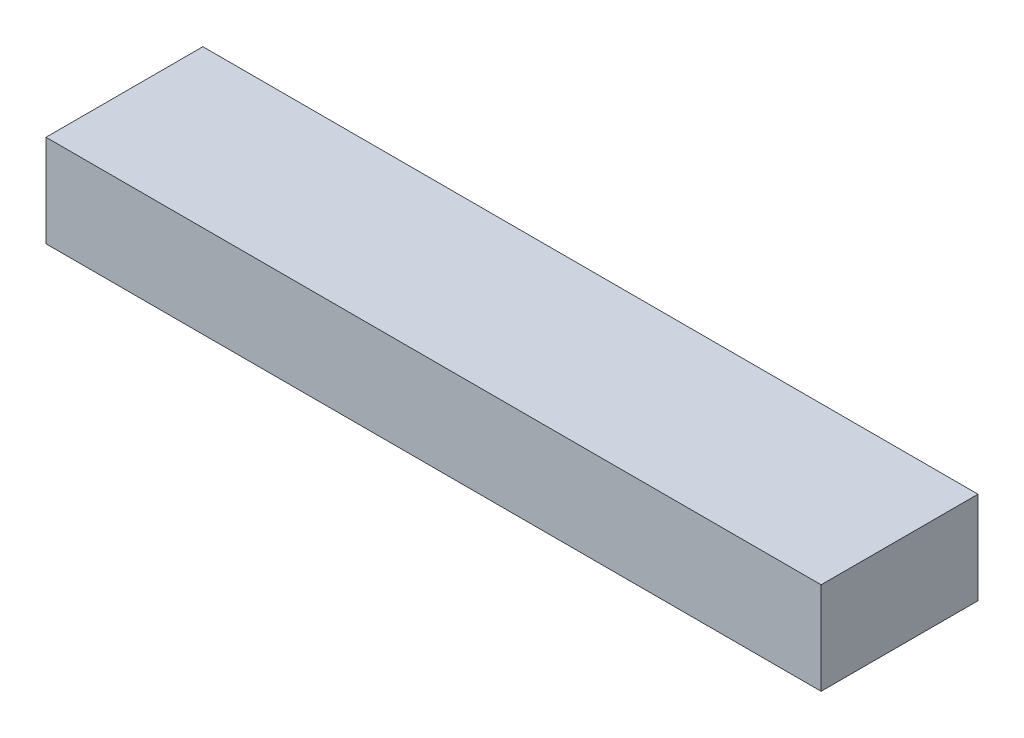
ISO-10303-21;
HEADER;
FILE_DESCRIPTION(('STEP AP214'),'2;1');
FILE_NAME('part.step','',(''),(''),'','','');
FILE_SCHEMA(('AUTOMOTIVE_DESIGN { 1 0 10303 214 1 1 1 1 }'));
ENDSEC;
DATA;
#1=APPLICATION_CONTEXT('core data for automotive mechanical design processes');
#2=APPLICATION_PROTOCOL_DEFINITION('international standard','automotive_design',2000,#1);
#3=PRODUCT_CONTEXT('',#1,'mechanical');
#4=PRODUCT('Part','Part','',(#3));
#5=PRODUCT_RELATED_PRODUCT_CATEGORY('part','',(#4));
#6=PRODUCT_DEFINITION_FORMATION('','',#4);
#7=PRODUCT_DEFINITION_CONTEXT('part definition',#1,'design');
#8=PRODUCT_DEFINITION('design','',#6,#7);
#9=PRODUCT_DEFINITION_SHAPE('','',#8);
#10=(LENGTH_UNIT() NAMED_UNIT(*) SI_UNIT(.MILLI.,.METRE.));
#11=(NAMED_UNIT(*) PLANE_ANGLE_UNIT() SI_UNIT($,.RADIAN.));
#12=(NAMED_UNIT(*) SI_UNIT($,.STERADIAN.) SOLID_ANGLE_UNIT());
#13=UNCERTAINTY_MEASURE_WITH_UNIT(LENGTH_MEASURE(1.E-05),#10,'distance_accuracy_value','');
#14=(GEOMETRIC_REPRESENTATION_CONTEXT(3) GLOBAL_UNCERTAINTY_ASSIGNED_CONTEXT((#13)) GLOBAL_UNIT_ASSIGNED_CONTEXT((#10,
#11,#12)) REPRESENTATION_CONTEXT('',''));
#15=CARTESIAN_POINT('',(0.,0.,0.));
#16=DIRECTION('',(0.,0.,1.));
#17=DIRECTION('',(1.,0.,0.));
#18=AXIS2_PLACEMENT_3D('',#15,#16,#17);
#19=CARTESIAN_POINT('',(42.,10.,-15.));
#20=DIRECTION('',(-1.,0.,0.));
#21=DIRECTION('',(0.,0.,1.));
#22=AXIS2_PLACEMENT_3D('',#19,#20,#21);
#23=PLANE('',#22);
#24=DIRECTION('',(0.,0.,-1.));
#25=VECTOR('',#24,1.);
#26=CARTESIAN_POINT('',(42.,0.,-15.));
#27=LINE('',#26,#25);
#28=CARTESIAN_POINT('',(42.,0.,2.00000000000002));
#29=VERTEX_POINT('',#28);
#30=CARTESIAN_POINT('',(42.,0.,-15.));
#31=VERTEX_POINT('',#30);
#32=EDGE_CURVE('E79',#29,#31,#27,.T.);
#33=ORIENTED_EDGE('',*,*,#32,.T.);
#34=DIRECTION('',(0.,-1.,0.));
#35=VECTOR('',#34,1.);
#36=CARTESIAN_POINT('',(42.,10.,-15.));
#37=LINE('',#36,#35);
#38=CARTESIAN_POINT('',(42.,10.,-15.));
#39=VERTEX_POINT('',#38);
#40=EDGE_CURVE('E11',#39,#31,#37,.T.);
#41=ORIENTED_EDGE('',*,*,#40,.F.);
#42=DIRECTION('',(0.,0.,-1.));
#43=VECTOR('',#42,1.);
#44=CARTESIAN_POINT('',(42.,10.,0.));
#45=LINE('',#44,#43);
#46=CARTESIAN_POINT('',(42.,10.,2.00000000000002));
#47=VERTEX_POINT('',#46);
#48=EDGE_CURVE('E84',#47,#39,#45,.T.);
#49=ORIENTED_EDGE('',*,*,#48,.F.);
#50=DIRECTION('',(0.,-1.,0.));
#51=VECTOR('',#50,1.);
#52=CARTESIAN_POINT('',(42.,10.,2.00000000000002));
#53=LINE('',#52,#51);
#54=EDGE_CURVE('E104',#47,#29,#53,.T.);
#55=ORIENTED_EDGE('',*,*,#54,.T.);
#56=EDGE_LOOP('',(#33,#41,#49,#55));
#57=FACE_BOUND('',#56,.T.);
#58=ADVANCED_FACE('F39',(#57),#23,.F.);
#59=CARTESIAN_POINT('',(-42.,10.,-15.));
#60=DIRECTION('',(0.,0.,1.));
#61=DIRECTION('',(1.,0.,0.));
#62=AXIS2_PLACEMENT_3D('',#59,#60,#61);
#63=PLANE('',#62);
#64=DIRECTION('',(-1.,0.,0.));
#65=VECTOR('',#64,1.);
#66=CARTESIAN_POINT('',(-42.,0.,-15.));
#67=LINE('',#66,#65);
#68=CARTESIAN_POINT('',(-42.,0.,-15.));
#69=VERTEX_POINT('',#68);
#70=EDGE_CURVE('E97',#31,#69,#67,.T.);
#71=ORIENTED_EDGE('',*,*,#70,.T.);
#72=DIRECTION('',(0.,-1.,0.));
#73=VECTOR('',#72,1.);
#74=CARTESIAN_POINT('',(-42.,10.,-15.));
#75=LINE('',#74,#73);
#76=CARTESIAN_POINT('',(-42.,10.,-15.));
#77=VERTEX_POINT('',#76);
#78=EDGE_CURVE('E48',#77,#69,#75,.T.);
#79=ORIENTED_EDGE('',*,*,#78,.F.);
#80=DIRECTION('',(-1.,0.,0.));
#81=VECTOR('',#80,1.);
#82=CARTESIAN_POINT('',(-42.,10.,-15.));
#83=LINE('',#82,#81);
#84=EDGE_CURVE('E87',#39,#77,#83,.T.);
#85=ORIENTED_EDGE('',*,*,#84,.F.);
#86=ORIENTED_EDGE('',*,*,#40,.T.);
#87=EDGE_LOOP('',(#71,#79,#85,#86));
#88=FACE_BOUND('',#87,.T.);
#89=ADVANCED_FACE('F96',(#88),#63,.F.);
#90=CARTESIAN_POINT('',(-42.,10.,2.));
#91=DIRECTION('',(1.,0.,0.));
#92=DIRECTION('',(0.,0.,-1.));
#93=AXIS2_PLACEMENT_3D('',#90,#91,#92);
#94=PLANE('',#93);
#95=DIRECTION('',(0.,0.,1.));
#96=VECTOR('',#95,1.);
#97=CARTESIAN_POINT('',(-42.,0.,2.));
#98=LINE('',#97,#96);
#99=CARTESIAN_POINT('',(-42.,0.,2.));
#100=VERTEX_POINT('',#99);
#101=EDGE_CURVE('E72',#69,#100,#98,.T.);
#102=ORIENTED_EDGE('',*,*,#101,.T.);
#103=DIRECTION('',(0.,-1.,0.));
#104=VECTOR('',#103,1.);
#105=CARTESIAN_POINT('',(-42.,10.,2.));
#106=LINE('',#105,#104);
#107=CARTESIAN_POINT('',(-42.,10.,2.));
#108=VERTEX_POINT('',#107);
#109=EDGE_CURVE('E99',#108,#100,#106,.T.);
#110=ORIENTED_EDGE('',*,*,#109,.F.);
#111=DIRECTION('',(0.,0.,1.));
#112=VECTOR('',#111,1.);
#113=CARTESIAN_POINT('',(-42.,10.,0.));
#114=LINE('',#113,#112);
#115=EDGE_CURVE('E91',#77,#108,#114,.T.);
#116=ORIENTED_EDGE('',*,*,#115,.F.);
#117=ORIENTED_EDGE('',*,*,#78,.T.);
#118=EDGE_LOOP('',(#102,#110,#116,#117));
#119=FACE_BOUND('',#118,.T.);
#120=ADVANCED_FACE('F100',(#119),#94,.F.);
#121=CARTESIAN_POINT('',(-42.,10.,2.));
#122=DIRECTION('',(0.,0.,-1.));
#123=DIRECTION('',(-1.,0.,0.));
#124=AXIS2_PLACEMENT_3D('',#121,#122,#123);
#125=PLANE('',#124);
#126=DIRECTION('',(1.,0.,0.));
#127=VECTOR('',#126,1.);
#128=CARTESIAN_POINT('',(-42.,0.,2.));
#129=LINE('',#128,#127);
#130=EDGE_CURVE('E115',#100,#29,#129,.T.);
#131=ORIENTED_EDGE('',*,*,#130,.T.);
#132=ORIENTED_EDGE('',*,*,#54,.F.);
#133=DIRECTION('',(1.,0.,0.));
#134=VECTOR('',#133,1.);
#135=CARTESIAN_POINT('',(-42.,10.,2.));
#136=LINE('',#135,#134);
#137=EDGE_CURVE('E56',#108,#47,#136,.T.);
#138=ORIENTED_EDGE('',*,*,#137,.F.);
#139=ORIENTED_EDGE('',*,*,#109,.T.);
#140=EDGE_LOOP('',(#131,#132,#138,#139));
#141=FACE_BOUND('',#140,.T.);
#142=ADVANCED_FACE('F123',(#141),#125,.F.);
#143=CARTESIAN_POINT('',(0.,10.,0.));
#144=DIRECTION('',(0.,1.,0.));
#145=DIRECTION('',(0.,0.,1.));
#146=AXIS2_PLACEMENT_3D('',#143,#144,#145);
#147=PLANE('',#146);
#148=ORIENTED_EDGE('',*,*,#48,.T.);
#149=ORIENTED_EDGE('',*,*,#84,.T.);
#150=ORIENTED_EDGE('',*,*,#115,.T.);
#151=ORIENTED_EDGE('',*,*,#137,.T.);
#152=EDGE_LOOP('',(#148,#149,#150,#151));
#153=FACE_BOUND('',#152,.T.);
#154=ADVANCED_FACE('F89',(#153),#147,.T.);
#155=CARTESIAN_POINT('',(0.,0.,0.));
#156=DIRECTION('',(0.,1.,0.));
#157=DIRECTION('',(0.,0.,1.));
#158=AXIS2_PLACEMENT_3D('',#155,#156,#157);
#159=PLANE('',#158);
#160=CARTESIAN_POINT('',(0.,0.,0.));
#161=DIRECTION('',(0.,1.,0.));
#162=DIRECTION('',(0.,0.,1.));
#163=AXIS2_PLACEMENT_3D('',#160,#161,#162);
#164=CIRCLE('',#163,1.);
#165=CARTESIAN_POINT('',(0.,0.,1.));
#166=VERTEX_POINT('',#165);
#167=EDGE_CURVE('E146',#166,#166,#164,.T.);
#168=ORIENTED_EDGE('',*,*,#167,.T.);
#169=EDGE_LOOP('',(#168));
#170=FACE_BOUND('',#169,.T.);
#171=ORIENTED_EDGE('',*,*,#32,.F.);
#172=ORIENTED_EDGE('',*,*,#130,.F.);
#173=ORIENTED_EDGE('',*,*,#101,.F.);
#174=ORIENTED_EDGE('',*,*,#70,.F.);
#175=EDGE_LOOP('',(#171,#172,#173,#174));
#176=FACE_BOUND('',#175,.T.);
#177=ADVANCED_FACE('F124',(#170,#176),#159,.F.);
#178=CARTESIAN_POINT('',(0.,0.0001,0.));
#179=DIRECTION('',(0.,-1.,0.));
#180=DIRECTION('',(0.,0.,-1.));
#181=AXIS2_PLACEMENT_3D('',#178,#179,#180);
#182=CYLINDRICAL_SURFACE('',#181,1.);
#183=CARTESIAN_POINT('',(0.,0.0001,0.));
#184=DIRECTION('',(0.,1.,0.));
#185=DIRECTION('',(0.,0.,1.));
#186=AXIS2_PLACEMENT_3D('',#183,#184,#185);
#187=CIRCLE('',#186,1.);
#188=CARTESIAN_POINT('',(0.,0.0001,1.));
#189=VERTEX_POINT('',#188);
#190=EDGE_CURVE('E110',#189,#189,#187,.T.);
#191=ORIENTED_EDGE('',*,*,#190,.T.);
#192=EDGE_LOOP('',(#191));
#193=FACE_BOUND('',#192,.T.);
#194=ORIENTED_EDGE('',*,*,#167,.F.);
#195=EDGE_LOOP('',(#194));
#196=FACE_BOUND('',#195,.T.);
#197=ADVANCED_FACE('F126',(#193,#196),#182,.F.);
#198=CARTESIAN_POINT('',(0.,0.0001,0.));
#199=DIRECTION('',(0.,1.,0.));
#200=DIRECTION('',(0.,0.,1.));
#201=AXIS2_PLACEMENT_3D('',#198,#199,#200);
#202=PLANE('',#201);
#203=ORIENTED_EDGE('',*,*,#190,.F.);
#204=EDGE_LOOP('',(#203));
#205=FACE_BOUND('',#204,.T.);
#206=ADVANCED_FACE('F133',(#205),#202,.F.);
#207=CLOSED_SHELL('',(#58,#89,#120,#142,#154,#177,#197,#206));
#208=MANIFOLD_SOLID_BREP('B2',#207);
#209=ADVANCED_BREP_SHAPE_REPRESENTATION('',(#18,#208),#14);
#210=SHAPE_DEFINITION_REPRESENTATION(#9,#209);
ENDSEC;
END-ISO-10303-21;
